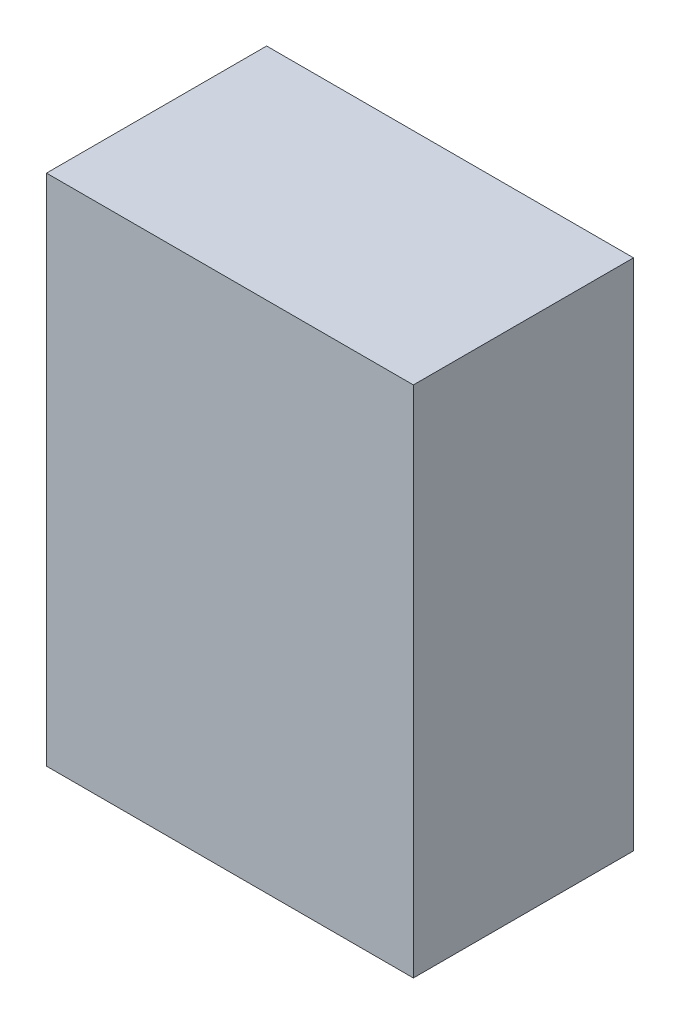
ISO-10303-21;
HEADER;
FILE_DESCRIPTION(('STEP AP214'),'2;1');
FILE_NAME('part.step','',(''),(''),'','','');
FILE_SCHEMA(('AUTOMOTIVE_DESIGN { 1 0 10303 214 1 1 1 1 }'));
ENDSEC;
DATA;
#1=APPLICATION_CONTEXT('core data for automotive mechanical design processes');
#2=APPLICATION_PROTOCOL_DEFINITION('international standard','automotive_design',2000,#1);
#3=PRODUCT_CONTEXT('',#1,'mechanical');
#4=PRODUCT('Part','Part','',(#3));
#5=PRODUCT_RELATED_PRODUCT_CATEGORY('part','',(#4));
#6=PRODUCT_DEFINITION_FORMATION('','',#4);
#7=PRODUCT_DEFINITION_CONTEXT('part definition',#1,'design');
#8=PRODUCT_DEFINITION('design','',#6,#7);
#9=PRODUCT_DEFINITION_SHAPE('','',#8);
#10=(LENGTH_UNIT() NAMED_UNIT(*) SI_UNIT(.MILLI.,.METRE.));
#11=(NAMED_UNIT(*) PLANE_ANGLE_UNIT() SI_UNIT($,.RADIAN.));
#12=(NAMED_UNIT(*) SI_UNIT($,.STERADIAN.) SOLID_ANGLE_UNIT());
#13=UNCERTAINTY_MEASURE_WITH_UNIT(LENGTH_MEASURE(1.E-05),#10,'distance_accuracy_value','');
#14=(GEOMETRIC_REPRESENTATION_CONTEXT(3) GLOBAL_UNCERTAINTY_ASSIGNED_CONTEXT((#13)) GLOBAL_UNIT_ASSIGNED_CONTEXT((#10,
#11,#12)) REPRESENTATION_CONTEXT('',''));
#15=CARTESIAN_POINT('',(0.,0.,0.));
#16=DIRECTION('',(0.,0.,1.));
#17=DIRECTION('',(1.,0.,0.));
#18=AXIS2_PLACEMENT_3D('',#15,#16,#17);
#19=CARTESIAN_POINT('',(0.,0.,15.));
#20=DIRECTION('',(1.,0.,0.));
#21=DIRECTION('',(0.,1.,0.));
#22=AXIS2_PLACEMENT_3D('',#19,#20,#21);
#23=PLANE('',#22);
#24=DIRECTION('',(0.,-1.,0.));
#25=VECTOR('',#24,1.);
#26=CARTESIAN_POINT('',(0.,0.,0.));
#27=LINE('',#26,#25);
#28=CARTESIAN_POINT('',(0.,0.,0.));
#29=VERTEX_POINT('',#28);
#30=CARTESIAN_POINT('',(0.,-35.,0.));
#31=VERTEX_POINT('',#30);
#32=EDGE_CURVE('E96',#29,#31,#27,.T.);
#33=ORIENTED_EDGE('',*,*,#32,.T.);
#34=DIRECTION('',(0.,0.,-1.));
#35=VECTOR('',#34,1.);
#36=CARTESIAN_POINT('',(0.,-35.,15.));
#37=LINE('',#36,#35);
#38=CARTESIAN_POINT('',(0.,-35.,15.));
#39=VERTEX_POINT('',#38);
#40=EDGE_CURVE('E11',#39,#31,#37,.T.);
#41=ORIENTED_EDGE('',*,*,#40,.F.);
#42=DIRECTION('',(0.,-1.,0.));
#43=VECTOR('',#42,1.);
#44=CARTESIAN_POINT('',(0.,0.,15.));
#45=LINE('',#44,#43);
#46=CARTESIAN_POINT('',(0.,0.,15.));
#47=VERTEX_POINT('',#46);
#48=EDGE_CURVE('E84',#47,#39,#45,.T.);
#49=ORIENTED_EDGE('',*,*,#48,.F.);
#50=DIRECTION('',(0.,0.,-1.));
#51=VECTOR('',#50,1.);
#52=CARTESIAN_POINT('',(0.,0.,15.));
#53=LINE('',#52,#51);
#54=EDGE_CURVE('E92',#47,#29,#53,.T.);
#55=ORIENTED_EDGE('',*,*,#54,.T.);
#56=EDGE_LOOP('',(#33,#41,#49,#55));
#57=FACE_BOUND('',#56,.T.);
#58=ADVANCED_FACE('F33',(#57),#23,.F.);
#59=CARTESIAN_POINT('',(0.,-35.,15.));
#60=DIRECTION('',(0.,1.,0.));
#61=DIRECTION('',(0.,0.,1.));
#62=AXIS2_PLACEMENT_3D('',#59,#60,#61);
#63=PLANE('',#62);
#64=DIRECTION('',(1.,0.,0.));
#65=VECTOR('',#64,1.);
#66=CARTESIAN_POINT('',(0.,-35.,0.));
#67=LINE('',#66,#65);
#68=CARTESIAN_POINT('',(25.,-35.,0.));
#69=VERTEX_POINT('',#68);
#70=EDGE_CURVE('E88',#31,#69,#67,.T.);
#71=ORIENTED_EDGE('',*,*,#70,.T.);
#72=DIRECTION('',(0.,0.,-1.));
#73=VECTOR('',#72,1.);
#74=CARTESIAN_POINT('',(25.,-35.,15.));
#75=LINE('',#74,#73);
#76=CARTESIAN_POINT('',(25.,-35.,15.));
#77=VERTEX_POINT('',#76);
#78=EDGE_CURVE('E41',#77,#69,#75,.T.);
#79=ORIENTED_EDGE('',*,*,#78,.F.);
#80=DIRECTION('',(1.,0.,0.));
#81=VECTOR('',#80,1.);
#82=CARTESIAN_POINT('',(0.,-35.,15.));
#83=LINE('',#82,#81);
#84=EDGE_CURVE('E79',#39,#77,#83,.T.);
#85=ORIENTED_EDGE('',*,*,#84,.F.);
#86=ORIENTED_EDGE('',*,*,#40,.T.);
#87=EDGE_LOOP('',(#71,#79,#85,#86));
#88=FACE_BOUND('',#87,.T.);
#89=ADVANCED_FACE('F87',(#88),#63,.F.);
#90=CARTESIAN_POINT('',(25.,0.,15.));
#91=DIRECTION('',(-1.,0.,0.));
#92=DIRECTION('',(0.,-1.,0.));
#93=AXIS2_PLACEMENT_3D('',#90,#91,#92);
#94=PLANE('',#93);
#95=DIRECTION('',(0.,1.,0.));
#96=VECTOR('',#95,1.);
#97=CARTESIAN_POINT('',(25.,0.,0.));
#98=LINE('',#97,#96);
#99=CARTESIAN_POINT('',(25.,0.,0.));
#100=VERTEX_POINT('',#99);
#101=EDGE_CURVE('E66',#69,#100,#98,.T.);
#102=ORIENTED_EDGE('',*,*,#101,.T.);
#103=DIRECTION('',(0.,0.,-1.));
#104=VECTOR('',#103,1.);
#105=CARTESIAN_POINT('',(25.,0.,15.));
#106=LINE('',#105,#104);
#107=CARTESIAN_POINT('',(25.,0.,15.));
#108=VERTEX_POINT('',#107);
#109=EDGE_CURVE('E89',#108,#100,#106,.T.);
#110=ORIENTED_EDGE('',*,*,#109,.F.);
#111=DIRECTION('',(0.,1.,0.));
#112=VECTOR('',#111,1.);
#113=CARTESIAN_POINT('',(25.,0.,15.));
#114=LINE('',#113,#112);
#115=EDGE_CURVE('E82',#77,#108,#114,.T.);
#116=ORIENTED_EDGE('',*,*,#115,.F.);
#117=ORIENTED_EDGE('',*,*,#78,.T.);
#118=EDGE_LOOP('',(#102,#110,#116,#117));
#119=FACE_BOUND('',#118,.T.);
#120=ADVANCED_FACE('F90',(#119),#94,.F.);
#121=CARTESIAN_POINT('',(0.,0.,15.));
#122=DIRECTION('',(0.,-1.,0.));
#123=DIRECTION('',(0.,0.,-1.));
#124=AXIS2_PLACEMENT_3D('',#121,#122,#123);
#125=PLANE('',#124);
#126=DIRECTION('',(-1.,0.,0.));
#127=VECTOR('',#126,1.);
#128=CARTESIAN_POINT('',(0.,0.,0.));
#129=LINE('',#128,#127);
#130=EDGE_CURVE('E72',#100,#29,#129,.T.);
#131=ORIENTED_EDGE('',*,*,#130,.T.);
#132=ORIENTED_EDGE('',*,*,#54,.F.);
#133=DIRECTION('',(-1.,0.,0.));
#134=VECTOR('',#133,1.);
#135=CARTESIAN_POINT('',(0.,0.,15.));
#136=LINE('',#135,#134);
#137=EDGE_CURVE('E49',#108,#47,#136,.T.);
#138=ORIENTED_EDGE('',*,*,#137,.F.);
#139=ORIENTED_EDGE('',*,*,#109,.T.);
#140=EDGE_LOOP('',(#131,#132,#138,#139));
#141=FACE_BOUND('',#140,.T.);
#142=ADVANCED_FACE('F103',(#141),#125,.F.);
#143=CARTESIAN_POINT('',(0.,0.,15.));
#144=DIRECTION('',(0.,0.,1.));
#145=DIRECTION('',(1.,0.,0.));
#146=AXIS2_PLACEMENT_3D('',#143,#144,#145);
#147=PLANE('',#146);
#148=ORIENTED_EDGE('',*,*,#48,.T.);
#149=ORIENTED_EDGE('',*,*,#84,.T.);
#150=ORIENTED_EDGE('',*,*,#115,.T.);
#151=ORIENTED_EDGE('',*,*,#137,.T.);
#152=EDGE_LOOP('',(#148,#149,#150,#151));
#153=FACE_BOUND('',#152,.T.);
#154=ADVANCED_FACE('F80',(#153),#147,.T.);
#155=CARTESIAN_POINT('',(0.,0.,0.));
#156=DIRECTION('',(0.,0.,1.));
#157=DIRECTION('',(1.,0.,0.));
#158=AXIS2_PLACEMENT_3D('',#155,#156,#157);
#159=PLANE('',#158);
#160=ORIENTED_EDGE('',*,*,#32,.F.);
#161=ORIENTED_EDGE('',*,*,#130,.F.);
#162=ORIENTED_EDGE('',*,*,#101,.F.);
#163=ORIENTED_EDGE('',*,*,#70,.F.);
#164=EDGE_LOOP('',(#160,#161,#162,#163));
#165=FACE_BOUND('',#164,.T.);
#166=ADVANCED_FACE('F106',(#165),#159,.F.);
#167=CLOSED_SHELL('',(#58,#89,#120,#142,#154,#166));
#168=MANIFOLD_SOLID_BREP('B2',#167);
#169=ADVANCED_BREP_SHAPE_REPRESENTATION('',(#18,#168),#14);
#170=SHAPE_DEFINITION_REPRESENTATION(#9,#169);
ENDSEC;
END-ISO-10303-21;
